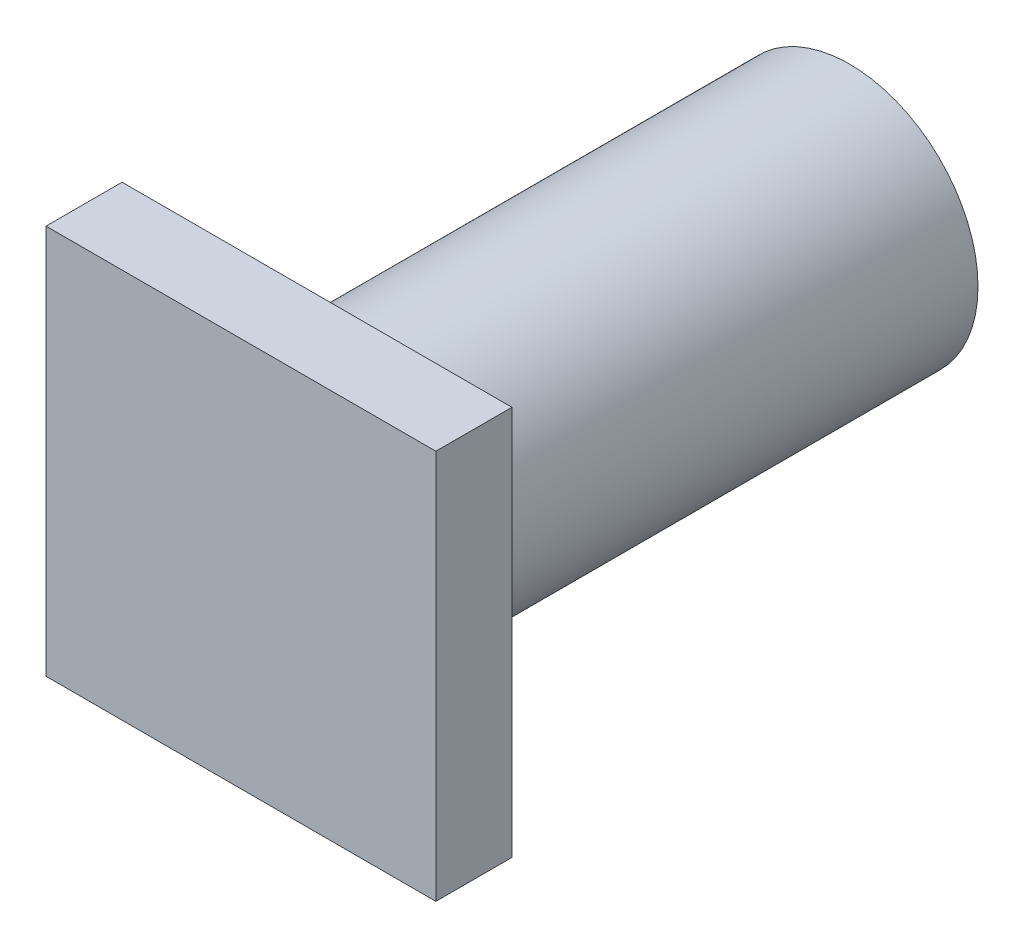
ISO-10303-21;
HEADER;
FILE_DESCRIPTION(('STEP AP214'),'2;1');
FILE_NAME('part.step','',(''),(''),'','','');
FILE_SCHEMA(('AUTOMOTIVE_DESIGN { 1 0 10303 214 1 1 1 1 }'));
ENDSEC;
DATA;
#1=APPLICATION_CONTEXT('core data for automotive mechanical design processes');
#2=APPLICATION_PROTOCOL_DEFINITION('international standard','automotive_design',2000,#1);
#3=PRODUCT_CONTEXT('',#1,'mechanical');
#4=PRODUCT('Part','Part','',(#3));
#5=PRODUCT_RELATED_PRODUCT_CATEGORY('part','',(#4));
#6=PRODUCT_DEFINITION_FORMATION('','',#4);
#7=PRODUCT_DEFINITION_CONTEXT('part definition',#1,'design');
#8=PRODUCT_DEFINITION('design','',#6,#7);
#9=PRODUCT_DEFINITION_SHAPE('','',#8);
#10=(LENGTH_UNIT() NAMED_UNIT(*) SI_UNIT(.MILLI.,.METRE.));
#11=(NAMED_UNIT(*) PLANE_ANGLE_UNIT() SI_UNIT($,.RADIAN.));
#12=(NAMED_UNIT(*) SI_UNIT($,.STERADIAN.) SOLID_ANGLE_UNIT());
#13=UNCERTAINTY_MEASURE_WITH_UNIT(LENGTH_MEASURE(1.E-05),#10,'distance_accuracy_value','');
#14=(GEOMETRIC_REPRESENTATION_CONTEXT(3) GLOBAL_UNCERTAINTY_ASSIGNED_CONTEXT((#13)) GLOBAL_UNIT_ASSIGNED_CONTEXT((#10,
#11,#12)) REPRESENTATION_CONTEXT('',''));
#15=CARTESIAN_POINT('',(0.,0.,0.));
#16=DIRECTION('',(0.,0.,1.));
#17=DIRECTION('',(1.,0.,0.));
#18=AXIS2_PLACEMENT_3D('',#15,#16,#17);
#19=CARTESIAN_POINT('',(-8.12331829174595,-5.92782686154433,70.));
#20=DIRECTION('',(0.,0.,-1.));
#21=DIRECTION('',(-1.,0.,0.));
#22=AXIS2_PLACEMENT_3D('',#19,#20,#21);
#23=CYLINDRICAL_SURFACE('',#22,16.8924483456144);
#24=CARTESIAN_POINT('',(-8.12331829174595,-5.92782686154433,70.));
#25=DIRECTION('',(0.,0.,1.));
#26=DIRECTION('',(1.,0.,0.));
#27=AXIS2_PLACEMENT_3D('',#24,#25,#26);
#28=CIRCLE('',#27,16.8924483456144);
#29=CARTESIAN_POINT('',(8.76913005386846,-5.92782686154433,70.));
#30=VERTEX_POINT('',#29);
#31=EDGE_CURVE('E11',#30,#30,#28,.T.);
#32=ORIENTED_EDGE('',*,*,#31,.F.);
#33=EDGE_LOOP('',(#32));
#34=FACE_BOUND('',#33,.T.);
#35=CARTESIAN_POINT('',(-8.12331829174595,-5.92782686154433,0.));
#36=DIRECTION('',(0.,0.,1.));
#37=DIRECTION('',(1.,0.,0.));
#38=AXIS2_PLACEMENT_3D('',#35,#36,#37);
#39=CIRCLE('',#38,16.8924483456144);
#40=CARTESIAN_POINT('',(8.76913005386846,-5.92782686154433,0.));
#41=VERTEX_POINT('',#40);
#42=EDGE_CURVE('E37',#41,#41,#39,.T.);
#43=ORIENTED_EDGE('',*,*,#42,.T.);
#44=EDGE_LOOP('',(#43));
#45=FACE_BOUND('',#44,.T.);
#46=ADVANCED_FACE('F34',(#34,#45),#23,.T.);
#47=CARTESIAN_POINT('',(-8.12331829174595,-5.92782686154433,0.));
#48=DIRECTION('',(0.,0.,1.));
#49=DIRECTION('',(1.,0.,0.));
#50=AXIS2_PLACEMENT_3D('',#47,#48,#49);
#51=PLANE('',#50);
#52=ORIENTED_EDGE('',*,*,#42,.F.);
#53=EDGE_LOOP('',(#52));
#54=FACE_BOUND('',#53,.T.);
#55=ADVANCED_FACE('F113',(#54),#51,.F.);
#56=CARTESIAN_POINT('',(17.5012455840344,-31.5523907373247,80.));
#57=DIRECTION('',(-1.,0.,0.));
#58=DIRECTION('',(0.,0.,1.));
#59=AXIS2_PLACEMENT_3D('',#56,#57,#58);
#60=PLANE('',#59);
#61=DIRECTION('',(0.,1.,0.));
#62=VECTOR('',#61,1.);
#63=CARTESIAN_POINT('',(17.5012455840344,-31.5523907373247,70.));
#64=LINE('',#63,#62);
#65=CARTESIAN_POINT('',(17.5012455840344,-31.5523907373247,70.));
#66=VERTEX_POINT('',#65);
#67=CARTESIAN_POINT('',(17.5012455840344,19.696737014236,70.));
#68=VERTEX_POINT('',#67);
#69=EDGE_CURVE('E101',#66,#68,#64,.T.);
#70=ORIENTED_EDGE('',*,*,#69,.T.);
#71=DIRECTION('',(0.,0.,-1.));
#72=VECTOR('',#71,1.);
#73=CARTESIAN_POINT('',(17.5012455840344,19.696737014236,80.));
#74=LINE('',#73,#72);
#75=CARTESIAN_POINT('',(17.5012455840344,19.696737014236,80.));
#76=VERTEX_POINT('',#75);
#77=EDGE_CURVE('E92',#76,#68,#74,.T.);
#78=ORIENTED_EDGE('',*,*,#77,.F.);
#79=DIRECTION('',(0.,1.,0.));
#80=VECTOR('',#79,1.);
#81=CARTESIAN_POINT('',(17.5012455840344,-31.5523907373247,80.));
#82=LINE('',#81,#80);
#83=CARTESIAN_POINT('',(17.5012455840344,-31.5523907373247,80.));
#84=VERTEX_POINT('',#83);
#85=EDGE_CURVE('E86',#84,#76,#82,.T.);
#86=ORIENTED_EDGE('',*,*,#85,.F.);
#87=DIRECTION('',(0.,0.,-1.));
#88=VECTOR('',#87,1.);
#89=CARTESIAN_POINT('',(17.5012455840344,-31.5523907373247,80.));
#90=LINE('',#89,#88);
#91=EDGE_CURVE('E97',#84,#66,#90,.T.);
#92=ORIENTED_EDGE('',*,*,#91,.T.);
#93=EDGE_LOOP('',(#70,#78,#86,#92));
#94=FACE_BOUND('',#93,.T.);
#95=ADVANCED_FACE('F115',(#94),#60,.F.);
#96=CARTESIAN_POINT('',(-33.7478821675263,19.696737014236,80.));
#97=DIRECTION('',(0.,-1.,0.));
#98=DIRECTION('',(0.,0.,-1.));
#99=AXIS2_PLACEMENT_3D('',#96,#97,#98);
#100=PLANE('',#99);
#101=DIRECTION('',(-1.,0.,0.));
#102=VECTOR('',#101,1.);
#103=CARTESIAN_POINT('',(-33.7478821675263,19.696737014236,70.));
#104=LINE('',#103,#102);
#105=CARTESIAN_POINT('',(-33.7478821675263,19.696737014236,70.));
#106=VERTEX_POINT('',#105);
#107=EDGE_CURVE('E91',#68,#106,#104,.T.);
#108=ORIENTED_EDGE('',*,*,#107,.T.);
#109=DIRECTION('',(0.,0.,-1.));
#110=VECTOR('',#109,1.);
#111=CARTESIAN_POINT('',(-33.7478821675263,19.696737014236,80.));
#112=LINE('',#111,#110);
#113=CARTESIAN_POINT('',(-33.7478821675263,19.696737014236,80.));
#114=VERTEX_POINT('',#113);
#115=EDGE_CURVE('E89',#114,#106,#112,.T.);
#116=ORIENTED_EDGE('',*,*,#115,.F.);
#117=DIRECTION('',(-1.,0.,0.));
#118=VECTOR('',#117,1.);
#119=CARTESIAN_POINT('',(-33.7478821675263,19.696737014236,80.));
#120=LINE('',#119,#118);
#121=EDGE_CURVE('E81',#76,#114,#120,.T.);
#122=ORIENTED_EDGE('',*,*,#121,.F.);
#123=ORIENTED_EDGE('',*,*,#77,.T.);
#124=EDGE_LOOP('',(#108,#116,#122,#123));
#125=FACE_BOUND('',#124,.T.);
#126=ADVANCED_FACE('F90',(#125),#100,.F.);
#127=CARTESIAN_POINT('',(-33.7478821675263,-31.5523907373247,80.));
#128=DIRECTION('',(1.,0.,0.));
#129=DIRECTION('',(0.,0.,-1.));
#130=AXIS2_PLACEMENT_3D('',#127,#128,#129);
#131=PLANE('',#130);
#132=DIRECTION('',(0.,-1.,0.));
#133=VECTOR('',#132,1.);
#134=CARTESIAN_POINT('',(-33.7478821675263,-31.5523907373247,70.));
#135=LINE('',#134,#133);
#136=CARTESIAN_POINT('',(-33.7478821675263,-31.5523907373247,70.));
#137=VERTEX_POINT('',#136);
#138=EDGE_CURVE('E67',#106,#137,#135,.T.);
#139=ORIENTED_EDGE('',*,*,#138,.T.);
#140=DIRECTION('',(0.,0.,-1.));
#141=VECTOR('',#140,1.);
#142=CARTESIAN_POINT('',(-33.7478821675263,-31.5523907373247,80.));
#143=LINE('',#142,#141);
#144=CARTESIAN_POINT('',(-33.7478821675263,-31.5523907373247,80.));
#145=VERTEX_POINT('',#144);
#146=EDGE_CURVE('E93',#145,#137,#143,.T.);
#147=ORIENTED_EDGE('',*,*,#146,.F.);
#148=DIRECTION('',(0.,-1.,0.));
#149=VECTOR('',#148,1.);
#150=CARTESIAN_POINT('',(-33.7478821675263,-31.5523907373247,80.));
#151=LINE('',#150,#149);
#152=EDGE_CURVE('E84',#114,#145,#151,.T.);
#153=ORIENTED_EDGE('',*,*,#152,.F.);
#154=ORIENTED_EDGE('',*,*,#115,.T.);
#155=EDGE_LOOP('',(#139,#147,#153,#154));
#156=FACE_BOUND('',#155,.T.);
#157=ADVANCED_FACE('F95',(#156),#131,.F.);
#158=CARTESIAN_POINT('',(-33.7478821675263,-31.5523907373247,80.));
#159=DIRECTION('',(0.,1.,0.));
#160=DIRECTION('',(0.,0.,1.));
#161=AXIS2_PLACEMENT_3D('',#158,#159,#160);
#162=PLANE('',#161);
#163=DIRECTION('',(1.,0.,0.));
#164=VECTOR('',#163,1.);
#165=CARTESIAN_POINT('',(-33.7478821675263,-31.5523907373247,70.));
#166=LINE('',#165,#164);
#167=EDGE_CURVE('E73',#137,#66,#166,.T.);
#168=ORIENTED_EDGE('',*,*,#167,.T.);
#169=ORIENTED_EDGE('',*,*,#91,.F.);
#170=DIRECTION('',(1.,0.,0.));
#171=VECTOR('',#170,1.);
#172=CARTESIAN_POINT('',(-33.7478821675263,-31.5523907373247,80.));
#173=LINE('',#172,#171);
#174=EDGE_CURVE('E50',#145,#84,#173,.T.);
#175=ORIENTED_EDGE('',*,*,#174,.F.);
#176=ORIENTED_EDGE('',*,*,#146,.T.);
#177=EDGE_LOOP('',(#168,#169,#175,#176));
#178=FACE_BOUND('',#177,.T.);
#179=ADVANCED_FACE('F128',(#178),#162,.F.);
#180=CARTESIAN_POINT('',(0.,0.,80.));
#181=DIRECTION('',(0.,0.,-1.));
#182=DIRECTION('',(-1.,0.,0.));
#183=AXIS2_PLACEMENT_3D('',#180,#181,#182);
#184=PLANE('',#183);
#185=ORIENTED_EDGE('',*,*,#85,.T.);
#186=ORIENTED_EDGE('',*,*,#121,.T.);
#187=ORIENTED_EDGE('',*,*,#152,.T.);
#188=ORIENTED_EDGE('',*,*,#174,.T.);
#189=EDGE_LOOP('',(#185,#186,#187,#188));
#190=FACE_BOUND('',#189,.T.);
#191=ADVANCED_FACE('F82',(#190),#184,.F.);
#192=CARTESIAN_POINT('',(0.,0.,70.));
#193=DIRECTION('',(0.,0.,-1.));
#194=DIRECTION('',(-1.,0.,0.));
#195=AXIS2_PLACEMENT_3D('',#192,#193,#194);
#196=PLANE('',#195);
#197=ORIENTED_EDGE('',*,*,#31,.T.);
#198=EDGE_LOOP('',(#197));
#199=FACE_BOUND('',#198,.T.);
#200=ORIENTED_EDGE('',*,*,#69,.F.);
#201=ORIENTED_EDGE('',*,*,#167,.F.);
#202=ORIENTED_EDGE('',*,*,#138,.F.);
#203=ORIENTED_EDGE('',*,*,#107,.F.);
#204=EDGE_LOOP('',(#200,#201,#202,#203));
#205=FACE_BOUND('',#204,.T.);
#206=ADVANCED_FACE('F131',(#199,#205),#196,.T.);
#207=CLOSED_SHELL('',(#46,#55,#95,#126,#157,#179,#191,#206));
#208=MANIFOLD_SOLID_BREP('B2',#207);
#209=ADVANCED_BREP_SHAPE_REPRESENTATION('',(#18,#208),#14);
#210=SHAPE_DEFINITION_REPRESENTATION(#9,#209);
ENDSEC;
END-ISO-10303-21;
